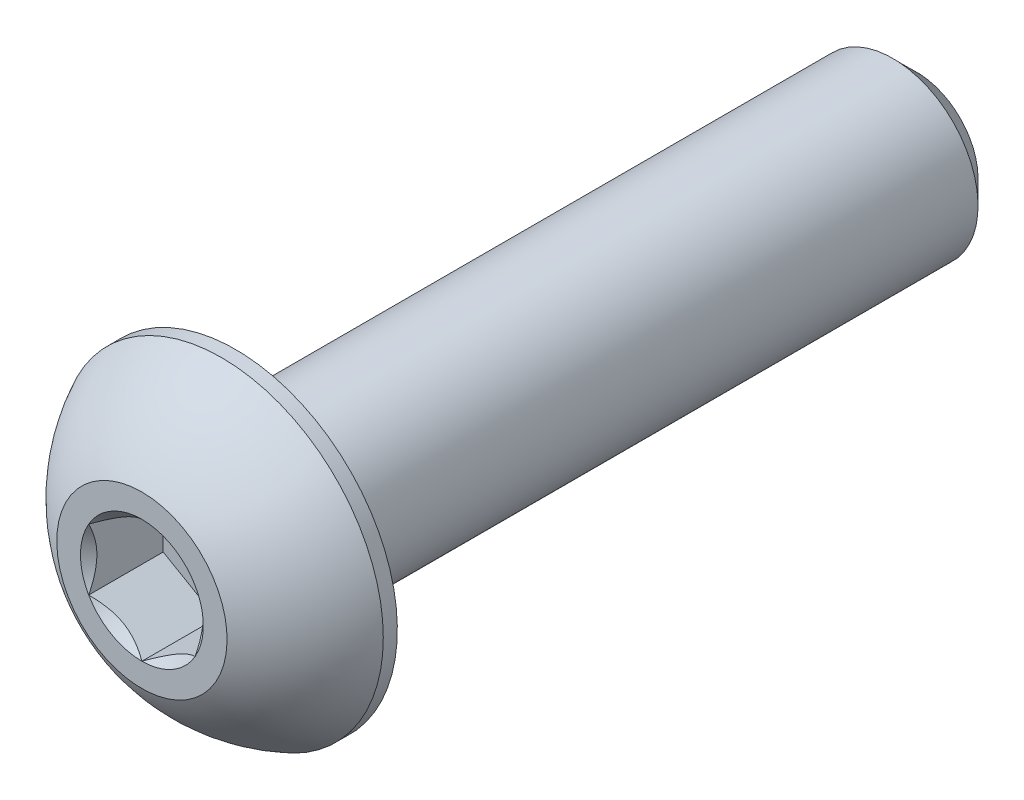
ISO-10303-21;
HEADER;
FILE_DESCRIPTION(('STEP AP214'),'2;1');
FILE_NAME('part.step','',(''),(''),'','','');
FILE_SCHEMA(('AUTOMOTIVE_DESIGN { 1 0 10303 214 1 1 1 1 }'));
ENDSEC;
DATA;
#1=APPLICATION_CONTEXT('core data for automotive mechanical design processes');
#2=APPLICATION_PROTOCOL_DEFINITION('international standard','automotive_design',2000,#1);
#3=PRODUCT_CONTEXT('',#1,'mechanical');
#4=PRODUCT('Part','Part','',(#3));
#5=PRODUCT_RELATED_PRODUCT_CATEGORY('part','',(#4));
#6=PRODUCT_DEFINITION_FORMATION('','',#4);
#7=PRODUCT_DEFINITION_CONTEXT('part definition',#1,'design');
#8=PRODUCT_DEFINITION('design','',#6,#7);
#9=PRODUCT_DEFINITION_SHAPE('','',#8);
#10=(LENGTH_UNIT() NAMED_UNIT(*) SI_UNIT(.MILLI.,.METRE.));
#11=(NAMED_UNIT(*) PLANE_ANGLE_UNIT() SI_UNIT($,.RADIAN.));
#12=(NAMED_UNIT(*) SI_UNIT($,.STERADIAN.) SOLID_ANGLE_UNIT());
#13=UNCERTAINTY_MEASURE_WITH_UNIT(LENGTH_MEASURE(1.E-05),#10,'distance_accuracy_value','');
#14=(GEOMETRIC_REPRESENTATION_CONTEXT(3) GLOBAL_UNCERTAINTY_ASSIGNED_CONTEXT((#13)) GLOBAL_UNIT_ASSIGNED_CONTEXT((#10,
#11,#12)) REPRESENTATION_CONTEXT('',''));
#15=CARTESIAN_POINT('',(0.,0.,0.));
#16=DIRECTION('',(0.,0.,1.));
#17=DIRECTION('',(1.,0.,0.));
#18=AXIS2_PLACEMENT_3D('',#15,#16,#17);
#19=CARTESIAN_POINT('',(0.,0.,9.1));
#20=DIRECTION('',(0.,0.,-1.));
#21=DIRECTION('',(0.,1.,0.));
#22=AXIS2_PLACEMENT_3D('',#19,#20,#21);
#23=PLANE('',#22);
#24=CARTESIAN_POINT('',(0.,0.,9.1));
#25=DIRECTION('',(0.,0.,1.));
#26=DIRECTION('',(1.,0.,0.));
#27=AXIS2_PLACEMENT_3D('',#24,#25,#26);
#28=CIRCLE('',#27,1.44337567297406);
#29=CARTESIAN_POINT('',(0.,1.44337567297406,9.1));
#30=VERTEX_POINT('',#29);
#31=CARTESIAN_POINT('',(-1.25,0.721687836487033,9.1));
#32=VERTEX_POINT('',#31);
#33=EDGE_CURVE('E216',#30,#32,#28,.T.);
#34=ORIENTED_EDGE('',*,*,#33,.F.);
#35=CARTESIAN_POINT('',(1.25,0.721687836487032,9.1));
#36=VERTEX_POINT('',#35);
#37=EDGE_CURVE('E218',#36,#30,#28,.T.);
#38=ORIENTED_EDGE('',*,*,#37,.F.);
#39=CARTESIAN_POINT('',(1.25,-0.721687836487032,9.1));
#40=VERTEX_POINT('',#39);
#41=EDGE_CURVE('E56',#40,#36,#28,.T.);
#42=ORIENTED_EDGE('',*,*,#41,.F.);
#43=CARTESIAN_POINT('',(0.,-1.44337567297406,9.1));
#44=VERTEX_POINT('',#43);
#45=EDGE_CURVE('E63',#44,#40,#28,.T.);
#46=ORIENTED_EDGE('',*,*,#45,.F.);
#47=CARTESIAN_POINT('',(-1.25,-0.721687836487033,9.1));
#48=VERTEX_POINT('',#47);
#49=EDGE_CURVE('E223',#48,#44,#28,.T.);
#50=ORIENTED_EDGE('',*,*,#49,.F.);
#51=EDGE_CURVE('E220',#32,#48,#28,.T.);
#52=ORIENTED_EDGE('',*,*,#51,.F.);
#53=EDGE_LOOP('',(#34,#38,#42,#46,#50,#52));
#54=FACE_BOUND('',#53,.T.);
#55=CARTESIAN_POINT('',(0.,0.,9.1));
#56=DIRECTION('',(0.,0.,1.));
#57=DIRECTION('',(0.,-1.,0.));
#58=AXIS2_PLACEMENT_3D('',#55,#56,#57);
#59=CIRCLE('',#58,2.);
#60=CARTESIAN_POINT('',(0.,2.,9.1));
#61=VERTEX_POINT('',#60);
#62=EDGE_CURVE('E50',#61,#61,#59,.T.);
#63=ORIENTED_EDGE('',*,*,#62,.T.);
#64=EDGE_LOOP('',(#63));
#65=FACE_BOUND('',#64,.T.);
#66=ADVANCED_FACE('F37',(#54,#65),#23,.F.);
#67=CARTESIAN_POINT('',(0.,0.,5.37355614973262));
#68=DIRECTION('',(0.,0.,1.));
#69=DIRECTION('',(0.,1.,0.));
#70=AXIS2_PLACEMENT_3D('',#67,#68,#69);
#71=SPHERICAL_SURFACE('',#70,4.22922968981298);
#72=CARTESIAN_POINT('',(0.,0.,7.23));
#73=DIRECTION('',(0.,0.,1.));
#74=DIRECTION('',(0.,-1.,0.));
#75=AXIS2_PLACEMENT_3D('',#72,#73,#74);
#76=CIRCLE('',#75,3.8);
#77=CARTESIAN_POINT('',(0.,3.8,7.23));
#78=VERTEX_POINT('',#77);
#79=EDGE_CURVE('E162',#78,#78,#76,.T.);
#80=CARTESIAN_POINT('',(0.,2.,9.1));
#81=CARTESIAN_POINT('',(0.,2.02421343985613,9.08700457403551));
#82=CARTESIAN_POINT('',(0.,2.04830018323974,9.07377308703487));
#83=CARTESIAN_POINT('',(0.,2.09621120342125,9.04684315849425));
#84=CARTESIAN_POINT('',(0.,2.12003548021916,9.03314471695428));
#85=CARTESIAN_POINT('',(0.,2.16741249358866,9.00528604686797));
#86=CARTESIAN_POINT('',(0.,2.19096523016025,8.99112581832164));
#87=CARTESIAN_POINT('',(0.,2.23779021933682,8.96234896476405));
#88=CARTESIAN_POINT('',(0.,2.2610624719418,8.94773233975278));
#89=CARTESIAN_POINT('',(0.,2.30731764886071,8.91804824448586));
#90=CARTESIAN_POINT('',(0.,2.33030057317464,8.9029807742302));
#91=CARTESIAN_POINT('',(0.,2.37596836104234,8.87240071441713));
#92=CARTESIAN_POINT('',(0.,2.39865322459611,8.85688812485971));
#93=CARTESIAN_POINT('',(0.,2.44371627121513,8.82542372060412));
#94=CARTESIAN_POINT('',(0.,2.46609445428037,8.80947190590595));
#95=CARTESIAN_POINT('',(0.,2.51053563686181,8.77713511266833));
#96=CARTESIAN_POINT('',(0.,2.532598636378,8.76075013412888));
#97=CARTESIAN_POINT('',(0.,2.57640106852491,8.72755323903277));
#98=CARTESIAN_POINT('',(0.,2.59814050115564,8.71074132247611));
#99=CARTESIAN_POINT('',(0.,2.64128753915153,8.67669693941185));
#100=CARTESIAN_POINT('',(0.,2.6626951445167,8.65946447290426));
#101=CARTESIAN_POINT('',(0.,2.70517039368395,8.62458553779704));
#102=CARTESIAN_POINT('',(0.,2.72623803748602,8.60693906919741));
#103=CARTESIAN_POINT('',(0.,2.76802535840618,8.57123883507559));
#104=CARTESIAN_POINT('',(0.,2.78874503552428,8.55318506955341));
#105=CARTESIAN_POINT('',(0.,2.82982855017313,8.51667710151719));
#106=CARTESIAN_POINT('',(0.,2.85019238770388,8.49822289900316));
#107=CARTESIAN_POINT('',(0.,2.89055648548394,8.46092106906898));
#108=CARTESIAN_POINT('',(0.,2.91055674573324,8.44207344164884));
#109=CARTESIAN_POINT('',(0.,2.95018608940552,8.40399192347874));
#110=CARTESIAN_POINT('',(0.,2.96981517282852,8.38475803272878));
#111=CARTESIAN_POINT('',(0.,3.00869470434027,8.34591129624471));
#112=CARTESIAN_POINT('',(0.,3.02794515242903,8.3262984505106));
#113=CARTESIAN_POINT('',(0.,3.06606009863533,8.28670125639628));
#114=CARTESIAN_POINT('',(0.,3.08492459675286,8.26671690801607));
#115=CARTESIAN_POINT('',(0.,3.12226047503002,8.22638430210832));
#116=CARTESIAN_POINT('',(0.,3.14073185518964,8.20603604458079));
#117=CARTESIAN_POINT('',(0.,3.17727447893821,8.16498335215256));
#118=CARTESIAN_POINT('',(0.,3.19534572252715,8.14427891725186));
#119=CARTESIAN_POINT('',(0.,3.23108120656242,8.10252173718902));
#120=CARTESIAN_POINT('',(0.,3.24874544700874,8.08146899202686));
#121=CARTESIAN_POINT('',(0.,3.28366021283673,8.03902319090103));
#122=CARTESIAN_POINT('',(0.,3.30091073821838,8.01763013493736));
#123=CARTESIAN_POINT('',(0.,3.33499151919534,7.97451184097717));
#124=CARTESIAN_POINT('',(0.,3.35182177479063,7.95278660298065));
#125=CARTESIAN_POINT('',(0.,3.38505562116371,7.90901219994321));
#126=CARTESIAN_POINT('',(0.,3.40145921194149,7.88696303490229));
#127=CARTESIAN_POINT('',(0.,3.43383349577046,7.84254915584848));
#128=CARTESIAN_POINT('',(0.,3.44980418882166,7.8201844418356));
#129=CARTESIAN_POINT('',(0.,3.48130660877275,7.77514796280767));
#130=CARTESIAN_POINT('',(0.,3.49683833567264,7.75247619779264));
#131=CARTESIAN_POINT('',(0.,3.52745692170931,7.70683423141033));
#132=CARTESIAN_POINT('',(0.,3.5425437808461,7.68386403004306));
#133=CARTESIAN_POINT('',(0.,3.57226689871518,7.63763391896935));
#134=CARTESIAN_POINT('',(0.,3.58690315744747,7.61437400926291));
#135=CARTESIAN_POINT('',(0.,3.61571951333199,7.56757331973341));
#136=CARTESIAN_POINT('',(0.,3.62989961048422,7.54403253991033));
#137=CARTESIAN_POINT('',(0.,3.65779825442823,7.4966790546141));
#138=CARTESIAN_POINT('',(0.,3.67151680122002,7.47286634914094));
#139=CARTESIAN_POINT('',(0.,3.69848713452321,7.42497806212234));
#140=CARTESIAN_POINT('',(0.,3.71173892103461,7.4009024805769));
#141=CARTESIAN_POINT('',(0.,3.73777068821038,7.35249758420785));
#142=CARTESIAN_POINT('',(0.,3.75055066887474,7.32816826938425));
#143=CARTESIAN_POINT('',(0.,3.77563400658953,7.27926517055481));
#144=CARTESIAN_POINT('',(0.,3.78793736363997,7.25469138654898));
#145=CARTESIAN_POINT('',(0.,3.8,7.23));
#146=B_SPLINE_CURVE_WITH_KNOTS('',3,(#80,#81,#82,#83,#84,#85,#86,#87,#88,#89,#90,#91,#92,#93,
#94,#95,#96,#97,#98,#99,#100,#101,#102,#103,#104,#105,#106,#107,#108,#109,#110,#111,#112,#113,
#114,#115,#116,#117,#118,#119,#120,#121,#122,#123,#124,#125,#126,#127,#128,#129,#130,#131,#132,
#133,#134,#135,#136,#137,#138,#139,#140,#141,#142,#143,#144,#145),.UNSPECIFIED.,.F.,.F.,(4,2,2,
2,2,2,2,2,2,2,2,2,2,2,2,2,2,2,2,2,2,2,2,2,2,2,2,2,2,2,2,2,4),(0.,0.0824398589102645,
0.164879717820529,0.247319576730793,0.329759435641057,0.412199294551322,0.494639153461586,
0.577079012371851,0.659518871282115,0.74195873019238,0.824398589102644,0.906838448012908,
0.989278306923173,1.07171816583344,1.1541580247437,1.23659788365397,1.31903774256423,
1.40147760147449,1.48391746038476,1.56635731929502,1.64879717820529,1.73123703711555,
1.81367689602582,1.89611675493608,1.97855661384634,2.06099647275661,2.14343633166687,
2.22587619057714,2.3083160494874,2.39075590839767,2.47319576730793,2.5556356262182,
2.63807548512846),.UNSPECIFIED.);
#147=EDGE_CURVE('BSEAM168',#61,#78,#146,.T.);
#148=ORIENTED_EDGE('',*,*,#62,.F.);
#149=ORIENTED_EDGE('',*,*,#79,.T.);
#150=ORIENTED_EDGE('',*,*,#147,.T.);
#151=ORIENTED_EDGE('',*,*,#147,.F.);
#152=EDGE_LOOP('',(#148,#150,#149,#151));
#153=FACE_BOUND('',#152,.T.);
#154=ADVANCED_FACE('F168',(#153),#71,.T.);
#155=CARTESIAN_POINT('',(0.,0.,9.1));
#156=DIRECTION('',(0.,0.,1.));
#157=DIRECTION('',(0.,-1.,0.));
#158=AXIS2_PLACEMENT_3D('',#155,#156,#157);
#159=CYLINDRICAL_SURFACE('',#158,3.8);
#160=ORIENTED_EDGE('',*,*,#79,.F.);
#161=EDGE_LOOP('',(#160));
#162=FACE_BOUND('',#161,.T.);
#163=CARTESIAN_POINT('',(0.,0.,6.9));
#164=DIRECTION('',(0.,0.,1.));
#165=DIRECTION('',(0.,-1.,0.));
#166=AXIS2_PLACEMENT_3D('',#163,#164,#165);
#167=CIRCLE('',#166,3.8);
#168=CARTESIAN_POINT('',(0.,-3.8,6.9));
#169=VERTEX_POINT('',#168);
#170=EDGE_CURVE('E159',#169,#169,#167,.T.);
#171=ORIENTED_EDGE('',*,*,#170,.T.);
#172=EDGE_LOOP('',(#171));
#173=FACE_BOUND('',#172,.T.);
#174=ADVANCED_FACE('F171',(#162,#173),#159,.T.);
#175=CARTESIAN_POINT('',(0.,2.,6.9));
#176=DIRECTION('',(0.,0.,1.));
#177=DIRECTION('',(0.,-1.,0.));
#178=AXIS2_PLACEMENT_3D('',#175,#176,#177);
#179=PLANE('',#178);
#180=ORIENTED_EDGE('',*,*,#170,.F.);
#181=EDGE_LOOP('',(#180));
#182=FACE_BOUND('',#181,.T.);
#183=CARTESIAN_POINT('',(0.,0.,6.9));
#184=DIRECTION('',(0.,0.,1.));
#185=DIRECTION('',(0.,-1.,0.));
#186=AXIS2_PLACEMENT_3D('',#183,#184,#185);
#187=CIRCLE('',#186,1.99999999999999);
#188=CARTESIAN_POINT('',(0.,-1.99999999999999,6.9));
#189=VERTEX_POINT('',#188);
#190=EDGE_CURVE('E156',#189,#189,#187,.T.);
#191=ORIENTED_EDGE('',*,*,#190,.T.);
#192=EDGE_LOOP('',(#191));
#193=FACE_BOUND('',#192,.T.);
#194=ADVANCED_FACE('F176',(#182,#193),#179,.F.);
#195=CARTESIAN_POINT('',(0.,0.,9.1));
#196=DIRECTION('',(0.,0.,1.));
#197=DIRECTION('',(0.,-1.,0.));
#198=AXIS2_PLACEMENT_3D('',#195,#196,#197);
#199=CYLINDRICAL_SURFACE('',#198,2.);
#200=ORIENTED_EDGE('',*,*,#190,.F.);
#201=EDGE_LOOP('',(#200));
#202=FACE_BOUND('',#201,.T.);
#203=CARTESIAN_POINT('',(0.,0.,-8.54));
#204=DIRECTION('',(0.,0.,1.));
#205=DIRECTION('',(0.,-1.,0.));
#206=AXIS2_PLACEMENT_3D('',#203,#204,#205);
#207=CIRCLE('',#206,2.);
#208=CARTESIAN_POINT('',(0.,-1.99999999999999,-8.54));
#209=VERTEX_POINT('',#208);
#210=EDGE_CURVE('E153',#209,#209,#207,.T.);
#211=ORIENTED_EDGE('',*,*,#210,.T.);
#212=EDGE_LOOP('',(#211));
#213=FACE_BOUND('',#212,.T.);
#214=ADVANCED_FACE('F182',(#202,#213),#199,.T.);
#215=CARTESIAN_POINT('',(0.,0.,-9.1));
#216=DIRECTION('',(0.,0.,1.));
#217=DIRECTION('',(0.,-1.,0.));
#218=AXIS2_PLACEMENT_3D('',#215,#216,#217);
#219=CONICAL_SURFACE('',#218,1.44,0.785398163397447);
#220=ORIENTED_EDGE('',*,*,#210,.F.);
#221=EDGE_LOOP('',(#220));
#222=FACE_BOUND('',#221,.T.);
#223=CARTESIAN_POINT('',(0.,0.,-9.1));
#224=DIRECTION('',(0.,0.,1.));
#225=DIRECTION('',(0.,-1.,0.));
#226=AXIS2_PLACEMENT_3D('',#223,#224,#225);
#227=CIRCLE('',#226,1.44);
#228=CARTESIAN_POINT('',(0.,-1.44,-9.1));
#229=VERTEX_POINT('',#228);
#230=EDGE_CURVE('E140',#229,#229,#227,.T.);
#231=ORIENTED_EDGE('',*,*,#230,.T.);
#232=EDGE_LOOP('',(#231));
#233=FACE_BOUND('',#232,.T.);
#234=ADVANCED_FACE('F188',(#222,#233),#219,.T.);
#235=CARTESIAN_POINT('',(0.,0.,-9.1));
#236=DIRECTION('',(0.,0.,1.));
#237=DIRECTION('',(0.,-1.,0.));
#238=AXIS2_PLACEMENT_3D('',#235,#236,#237);
#239=PLANE('',#238);
#240=ORIENTED_EDGE('',*,*,#230,.F.);
#241=EDGE_LOOP('',(#240));
#242=FACE_BOUND('',#241,.T.);
#243=ADVANCED_FACE('F194',(#242),#239,.F.);
#244=CARTESIAN_POINT('',(0.,0.,9.1));
#245=DIRECTION('',(0.,0.,1.));
#246=DIRECTION('',(1.,0.,0.));
#247=AXIS2_PLACEMENT_3D('',#244,#245,#246);
#248=CONICAL_SURFACE('',#247,1.44337567297406,0.78539816339745);
#249=ORIENTED_EDGE('',*,*,#33,.T.);
#250=CARTESIAN_POINT('',(0.000199999999999687,1.4434911430279,9.10011548390914));
#251=CARTESIAN_POINT('',(-0.0427751670715871,1.41867941875065,9.0753216680551));
#252=CARTESIAN_POINT('',(-0.0864690047459485,1.39345276980743,9.05198373441868));
#253=CARTESIAN_POINT('',(-0.175565930841942,1.34201263554194,9.00925200408454));
#254=CARTESIAN_POINT('',(-0.220977498357064,1.31579425481276,8.98988199236041));
#255=CARTESIAN_POINT('',(-0.31254782093526,1.26292610442246,8.95670048341348));
#256=CARTESIAN_POINT('',(-0.358683240175886,1.23628980770471,8.94280555905266));
#257=CARTESIAN_POINT('',(-0.451970080407593,1.18243062538508,8.92139728216064));
#258=CARTESIAN_POINT('',(-0.49911864913638,1.15520938653761,8.91386794156679));
#259=CARTESIAN_POINT('',(-0.580373556887252,1.10829684367467,8.9070744980507));
#260=CARTESIAN_POINT('',(-0.614374876627941,1.08866617256958,8.90606855910435));
#261=CARTESIAN_POINT('',(-0.682317764432477,1.04943932800611,8.90776141491132));
#262=CARTESIAN_POINT('',(-0.716259317655657,1.02984316311599,8.91046102721554));
#263=CARTESIAN_POINT('',(-0.783814856457499,0.9908399546035,8.91940893031638));
#264=CARTESIAN_POINT('',(-0.817428507286775,0.971433104248771,8.92566052589971));
#265=CARTESIAN_POINT('',(-0.884094638217813,0.932943395609906,8.9413756814139));
#266=CARTESIAN_POINT('',(-0.917146871030295,0.913860680098301,8.95084062008746));
#267=CARTESIAN_POINT('',(-1.00179969160026,0.864986351354568,8.97893139068758));
#268=CARTESIAN_POINT('',(-1.05286649242964,0.835502920149076,8.9996701574522));
#269=CARTESIAN_POINT('',(-1.15300085411325,0.777690319475909,9.04638713467148));
#270=CARTESIAN_POINT('',(-1.20207431157827,0.749357745598417,9.07234829594677));
#271=CARTESIAN_POINT('',(-1.2502,0.721572366433195,9.10011548390914));
#272=B_SPLINE_CURVE_WITH_KNOTS('',3,(#250,#251,#252,#253,#254,#255,#256,#257,#258,#259,#260,
#261,#262,#263,#264,#265,#266,#267,#268,#269,#270,#271),.UNSPECIFIED.,.F.,.F.,(4,2,2,2,2,2,2,2,
2,2,4),(0.,0.166533409618304,0.334037607289761,0.498880396489697,0.663307919240274,
0.780963963458826,0.898645970148452,1.01643764860773,1.13427993171549,1.32148652032141,
1.50809158792573),.UNSPECIFIED.);
#273=EDGE_CURVE('E11',#30,#32,#272,.T.);
#274=ORIENTED_EDGE('',*,*,#273,.F.);
#275=EDGE_LOOP('',(#249,#274));
#276=FACE_BOUND('',#275,.T.);
#277=ADVANCED_FACE('F199',(#276),#248,.F.);
#278=ORIENTED_EDGE('',*,*,#51,.T.);
#279=CARTESIAN_POINT('',(-1.25,-1.43934010808077,9.56298209689233));
#280=CARTESIAN_POINT('',(-1.25,-1.40429313005659,9.53652492263289));
#281=CARTESIAN_POINT('',(-1.25,-1.36905087135599,9.51032716035428));
#282=CARTESIAN_POINT('',(-1.25,-1.29809650706311,9.45855757183958));
#283=CARTESIAN_POINT('',(-1.25,-1.26238428576495,9.4329859043563));
#284=CARTESIAN_POINT('',(-1.25,-1.15390111792708,9.35700599368946));
#285=CARTESIAN_POINT('',(-1.25,-1.08031646726264,9.30774028618957));
#286=CARTESIAN_POINT('',(-1.25,-0.926012322755095,9.21102583026313));
#287=CARTESIAN_POINT('',(-1.25,-0.845125318656146,9.1638412989418));
#288=CARTESIAN_POINT('',(-1.25,-0.679311174076602,9.07753073439041));
#289=CARTESIAN_POINT('',(-1.25,-0.594398891026688,9.0383775346269));
#290=CARTESIAN_POINT('',(-1.25,-0.46694481246074,8.99047722368829));
#291=CARTESIAN_POINT('',(-1.25,-0.426289985812821,8.97672948978634));
#292=CARTESIAN_POINT('',(-1.25,-0.343998850091267,8.95249792745054));
#293=CARTESIAN_POINT('',(-1.25,-0.302362473614962,8.94201432386977));
#294=CARTESIAN_POINT('',(-1.25,-0.219052696285666,8.9250301617483));
#295=CARTESIAN_POINT('',(-1.25,-0.1773934284745,8.91846136047137));
#296=CARTESIAN_POINT('',(-1.25,-0.0936293693401927,8.90943505345776));
#297=CARTESIAN_POINT('',(-1.25,-0.0515246558543966,8.90697684099727));
#298=CARTESIAN_POINT('',(-1.25,0.0311890576306309,8.90635406201329));
#299=CARTESIAN_POINT('',(-1.25,0.0717969625499297,8.90803711684625));
#300=CARTESIAN_POINT('',(-1.25,0.152668636885196,8.91526827059791));
#301=CARTESIAN_POINT('',(-1.25,0.192932338835357,8.92081711041311));
#302=CARTESIAN_POINT('',(-1.25,0.273499879165294,8.93557103646495));
#303=CARTESIAN_POINT('',(-1.25,0.31379218061851,8.9448381759641));
#304=CARTESIAN_POINT('',(-1.25,0.393496413911456,8.96653617845735));
#305=CARTESIAN_POINT('',(-1.25,0.432908419115058,8.97896677673064));
#306=CARTESIAN_POINT('',(-1.25,0.556992735862297,9.02277935293144));
#307=CARTESIAN_POINT('',(-1.25,0.639898924666084,9.05915107287595));
#308=CARTESIAN_POINT('',(-1.25,0.8018165554997,9.14001916217833));
#309=CARTESIAN_POINT('',(-1.25,0.880812666325043,9.18454472091199));
#310=CARTESIAN_POINT('',(-1.25,1.0317856127975,9.27640487666662));
#311=CARTESIAN_POINT('',(-1.25,1.10391618485086,9.32348993391625));
#312=CARTESIAN_POINT('',(-1.25,1.2101860604331,9.39627856159854));
#313=CARTESIAN_POINT('',(-1.25,1.24515069969379,9.42079808539336));
#314=CARTESIAN_POINT('',(-1.25,1.31460220852736,9.47048563676568));
#315=CARTESIAN_POINT('',(-1.25,1.34908920596618,9.49565348541552));
#316=CARTESIAN_POINT('',(-1.25,1.38337731682911,9.52109014884121));
#317=B_SPLINE_CURVE_WITH_KNOTS('',3,(#279,#280,#281,#282,#283,#284,#285,#286,#287,#288,#289,
#290,#291,#292,#293,#294,#295,#296,#297,#298,#299,#300,#301,#302,#303,#304,#305,#306,#307,#308,
#309,#310,#311,#312,#313,#314,#315,#316),.UNSPECIFIED.,.F.,.F.,(4,2,2,2,2,2,2,2,2,2,2,2,2,2,2,2,
2,2,4),(0.,0.131732960381448,0.263498984161645,0.529042014455826,0.80974192613462,
1.08947609717225,1.21811634272577,1.346765447839,1.47310084517844,1.59941451973784,
1.72115042167849,1.84290966131735,1.96679153905342,2.09066305366039,2.36146692896009,
2.63325989198491,2.89154668212279,3.01965734507713,3.14773302245628),.UNSPECIFIED.);
#318=EDGE_CURVE('E222',#32,#48,#317,.F.);
#319=ORIENTED_EDGE('',*,*,#318,.F.);
#320=EDGE_LOOP('',(#278,#319));
#321=FACE_BOUND('',#320,.T.);
#322=ADVANCED_FACE('F205',(#321),#248,.F.);
#323=ORIENTED_EDGE('',*,*,#49,.T.);
#324=CARTESIAN_POINT('',(-1.2502,-0.721572366433194,9.10011548390914));
#325=CARTESIAN_POINT('',(-1.20722483292841,-0.746384090710444,9.0753216680551));
#326=CARTESIAN_POINT('',(-1.16353099525405,-0.771610739653665,9.05198373441868));
#327=CARTESIAN_POINT('',(-1.07443406915806,-0.823050873919155,9.00925200408454));
#328=CARTESIAN_POINT('',(-1.02902250164294,-0.849269254648334,8.98988199236041));
#329=CARTESIAN_POINT('',(-0.937452179064739,-0.902137405038636,8.95670048341348));
#330=CARTESIAN_POINT('',(-0.891316759824113,-0.928773701756388,8.94280555905265));
#331=CARTESIAN_POINT('',(-0.798029919592406,-0.982632884076013,8.92139728216064));
#332=CARTESIAN_POINT('',(-0.750881350863619,-1.00985412292348,8.91386794156679));
#333=CARTESIAN_POINT('',(-0.669626443112747,-1.05676666578643,8.9070744980507));
#334=CARTESIAN_POINT('',(-0.635625123372058,-1.07639733689152,8.90606855910435));
#335=CARTESIAN_POINT('',(-0.567682235567522,-1.11562418145499,8.90776141491132));
#336=CARTESIAN_POINT('',(-0.533740682344342,-1.1352203463451,8.91046102721554));
#337=CARTESIAN_POINT('',(-0.4661851435425,-1.1742235548576,8.91940893031638));
#338=CARTESIAN_POINT('',(-0.432571492713224,-1.19363040521233,8.92566052589971));
#339=CARTESIAN_POINT('',(-0.365905361782186,-1.23212011385119,8.9413756814139));
#340=CARTESIAN_POINT('',(-0.332853128969704,-1.2512028293628,8.95084062008746));
#341=CARTESIAN_POINT('',(-0.248200308399735,-1.30007715810653,8.97893139068758));
#342=CARTESIAN_POINT('',(-0.197133507570362,-1.32956058931202,8.9996701574522));
#343=CARTESIAN_POINT('',(-0.0969991458867455,-1.38737318998519,9.04638713467148));
#344=CARTESIAN_POINT('',(-0.0479256884217311,-1.41570576386268,9.07234829594677));
#345=CARTESIAN_POINT('',(0.000199999999999445,-1.4434911430279,9.10011548390914));
#346=B_SPLINE_CURVE_WITH_KNOTS('',3,(#324,#325,#326,#327,#328,#329,#330,#331,#332,#333,#334,
#335,#336,#337,#338,#339,#340,#341,#342,#343,#344,#345),.UNSPECIFIED.,.F.,.F.,(4,2,2,2,2,2,2,2,
2,2,4),(0.,0.166533409618305,0.334037607289762,0.498880396489699,0.663307919240275,
0.780963963458827,0.898645970148453,1.01643764860773,1.1342799317155,1.32148652032141,
1.50809158792573),.UNSPECIFIED.);
#347=EDGE_CURVE('E232',#48,#44,#346,.T.);
#348=ORIENTED_EDGE('',*,*,#347,.F.);
#349=EDGE_LOOP('',(#323,#348));
#350=FACE_BOUND('',#349,.T.);
#351=ADVANCED_FACE('F282',(#350),#248,.F.);
#352=ORIENTED_EDGE('',*,*,#45,.T.);
#353=CARTESIAN_POINT('',(-0.000200000000000272,-1.4434911430279,9.10011548390914));
#354=CARTESIAN_POINT('',(0.0427751670715867,-1.41867941875065,9.0753216680551));
#355=CARTESIAN_POINT('',(0.0864690047459484,-1.39345276980743,9.05198373441868));
#356=CARTESIAN_POINT('',(0.175565930841943,-1.34201263554194,9.00925200408454));
#357=CARTESIAN_POINT('',(0.220977498357065,-1.31579425481276,8.98988199236041));
#358=CARTESIAN_POINT('',(0.31254782093526,-1.26292610442246,8.95670048341348));
#359=CARTESIAN_POINT('',(0.358683240175886,-1.23628980770471,8.94280555905265));
#360=CARTESIAN_POINT('',(0.451970080407593,-1.18243062538508,8.92139728216064));
#361=CARTESIAN_POINT('',(0.499118649136381,-1.15520938653761,8.91386794156679));
#362=CARTESIAN_POINT('',(0.580373556887253,-1.10829684367467,8.9070744980507));
#363=CARTESIAN_POINT('',(0.614374876627942,-1.08866617256958,8.90606855910435));
#364=CARTESIAN_POINT('',(0.682317764432478,-1.04943932800611,8.90776141491132));
#365=CARTESIAN_POINT('',(0.716259317655658,-1.02984316311599,8.91046102721554));
#366=CARTESIAN_POINT('',(0.7838148564575,-0.990839954603498,8.91940893031638));
#367=CARTESIAN_POINT('',(0.817428507286776,-0.97143310424877,8.92566052589971));
#368=CARTESIAN_POINT('',(0.884094638217814,-0.932943395609904,8.9413756814139));
#369=CARTESIAN_POINT('',(0.917146871030297,-0.9138606800983,8.95084062008746));
#370=CARTESIAN_POINT('',(1.00179969160026,-0.864986351354567,8.97893139068758));
#371=CARTESIAN_POINT('',(1.05286649242964,-0.835502920149076,8.9996701574522));
#372=CARTESIAN_POINT('',(1.15300085411325,-0.777690319475909,9.04638713467148));
#373=CARTESIAN_POINT('',(1.20207431157827,-0.749357745598417,9.07234829594677));
#374=CARTESIAN_POINT('',(1.2502,-0.721572366433194,9.10011548390914));
#375=B_SPLINE_CURVE_WITH_KNOTS('',3,(#353,#354,#355,#356,#357,#358,#359,#360,#361,#362,#363,
#364,#365,#366,#367,#368,#369,#370,#371,#372,#373,#374),.UNSPECIFIED.,.F.,.F.,(4,2,2,2,2,2,2,2,
2,2,4),(0.,0.166533409618305,0.334037607289762,0.498880396489699,0.663307919240275,
0.780963963458828,0.898645970148454,1.01643764860773,1.1342799317155,1.32148652032141,
1.50809158792573),.UNSPECIFIED.);
#376=EDGE_CURVE('E270',#44,#40,#375,.T.);
#377=ORIENTED_EDGE('',*,*,#376,.F.);
#378=EDGE_LOOP('',(#352,#377));
#379=FACE_BOUND('',#378,.T.);
#380=ADVANCED_FACE('F283',(#379),#248,.F.);
#381=ORIENTED_EDGE('',*,*,#41,.T.);
#382=CARTESIAN_POINT('',(1.25,-1.43934010808077,9.56298209689233));
#383=CARTESIAN_POINT('',(1.25,-1.40429313005659,9.53652492263289));
#384=CARTESIAN_POINT('',(1.25,-1.36905087135599,9.51032716035428));
#385=CARTESIAN_POINT('',(1.25,-1.29809650706311,9.45855757183958));
#386=CARTESIAN_POINT('',(1.25,-1.26238428576495,9.4329859043563));
#387=CARTESIAN_POINT('',(1.25,-1.15390111792708,9.35700599368946));
#388=CARTESIAN_POINT('',(1.25,-1.08031646726264,9.30774028618957));
#389=CARTESIAN_POINT('',(1.25,-0.926012322755094,9.21102583026313));
#390=CARTESIAN_POINT('',(1.25,-0.845125318656145,9.1638412989418));
#391=CARTESIAN_POINT('',(1.25,-0.679311174076601,9.07753073439041));
#392=CARTESIAN_POINT('',(1.25,-0.594398891026687,9.0383775346269));
#393=CARTESIAN_POINT('',(1.25,-0.466944812460739,8.99047722368829));
#394=CARTESIAN_POINT('',(1.25,-0.426289985812821,8.97672948978634));
#395=CARTESIAN_POINT('',(1.25,-0.343998850091267,8.95249792745054));
#396=CARTESIAN_POINT('',(1.25,-0.302362473614961,8.94201432386977));
#397=CARTESIAN_POINT('',(1.25,-0.219052696285665,8.9250301617483));
#398=CARTESIAN_POINT('',(1.25,-0.1773934284745,8.91846136047137));
#399=CARTESIAN_POINT('',(1.25,-0.0936293693401918,8.90943505345776));
#400=CARTESIAN_POINT('',(1.25,-0.0515246558543957,8.90697684099727));
#401=CARTESIAN_POINT('',(1.25,0.0311890576306319,8.90635406201329));
#402=CARTESIAN_POINT('',(1.25,0.0717969625499308,8.90803711684625));
#403=CARTESIAN_POINT('',(1.25,0.152668636885198,8.91526827059791));
#404=CARTESIAN_POINT('',(1.25,0.192932338835358,8.92081711041311));
#405=CARTESIAN_POINT('',(1.25,0.273499879165296,8.93557103646495));
#406=CARTESIAN_POINT('',(1.25,0.313792180618512,8.9448381759641));
#407=CARTESIAN_POINT('',(1.25,0.393496413911458,8.96653617845735));
#408=CARTESIAN_POINT('',(1.25,0.432908419115059,8.97896677673064));
#409=CARTESIAN_POINT('',(1.25,0.556992735862298,9.02277935293144));
#410=CARTESIAN_POINT('',(1.25,0.639898924666086,9.05915107287596));
#411=CARTESIAN_POINT('',(1.25,0.801816555499702,9.14001916217834));
#412=CARTESIAN_POINT('',(1.25,0.880812666325045,9.18454472091199));
#413=CARTESIAN_POINT('',(1.25,1.0317856127975,9.27640487666662));
#414=CARTESIAN_POINT('',(1.25,1.10391618485086,9.32348993391625));
#415=CARTESIAN_POINT('',(1.25,1.2101860604331,9.39627856159854));
#416=CARTESIAN_POINT('',(1.25,1.24515069969379,9.42079808539336));
#417=CARTESIAN_POINT('',(1.25,1.31460220852736,9.47048563676568));
#418=CARTESIAN_POINT('',(1.25,1.34908920596618,9.49565348541552));
#419=CARTESIAN_POINT('',(1.25,1.38337731682912,9.52109014884121));
#420=B_SPLINE_CURVE_WITH_KNOTS('',3,(#382,#383,#384,#385,#386,#387,#388,#389,#390,#391,#392,
#393,#394,#395,#396,#397,#398,#399,#400,#401,#402,#403,#404,#405,#406,#407,#408,#409,#410,#411,
#412,#413,#414,#415,#416,#417,#418,#419),.UNSPECIFIED.,.F.,.F.,(4,2,2,2,2,2,2,2,2,2,2,2,2,2,2,2,
2,2,4),(0.,0.131732960381448,0.263498984161644,0.529042014455826,0.80974192613462,
1.08947609717225,1.21811634272577,1.346765447839,1.47310084517844,1.59941451973784,
1.72115042167849,1.84290966131735,1.96679153905342,2.09066305366039,2.36146692896009,
2.63325989198491,2.89154668212279,3.01965734507713,3.14773302245628),.UNSPECIFIED.);
#421=EDGE_CURVE('E122',#40,#36,#420,.T.);
#422=ORIENTED_EDGE('',*,*,#421,.F.);
#423=EDGE_LOOP('',(#381,#422));
#424=FACE_BOUND('',#423,.T.);
#425=ADVANCED_FACE('F285',(#424),#248,.F.);
#426=ORIENTED_EDGE('',*,*,#37,.T.);
#427=CARTESIAN_POINT('',(1.2502,0.721572366433194,9.10011548390914));
#428=CARTESIAN_POINT('',(1.20722483292841,0.746384090710444,9.0753216680551));
#429=CARTESIAN_POINT('',(1.16353099525405,0.771610739653665,9.05198373441868));
#430=CARTESIAN_POINT('',(1.07443406915806,0.823050873919155,9.00925200408454));
#431=CARTESIAN_POINT('',(1.02902250164294,0.849269254648334,8.98988199236041));
#432=CARTESIAN_POINT('',(0.937452179064739,0.902137405038636,8.95670048341348));
#433=CARTESIAN_POINT('',(0.891316759824113,0.928773701756388,8.94280555905265));
#434=CARTESIAN_POINT('',(0.798029919592406,0.982632884076013,8.92139728216064));
#435=CARTESIAN_POINT('',(0.750881350863619,1.00985412292348,8.91386794156679));
#436=CARTESIAN_POINT('',(0.669626443112746,1.05676666578643,8.9070744980507));
#437=CARTESIAN_POINT('',(0.635625123372058,1.07639733689152,8.90606855910435));
#438=CARTESIAN_POINT('',(0.567682235567521,1.11562418145499,8.90776141491132));
#439=CARTESIAN_POINT('',(0.533740682344341,1.1352203463451,8.91046102721554));
#440=CARTESIAN_POINT('',(0.466185143542499,1.1742235548576,8.91940893031638));
#441=CARTESIAN_POINT('',(0.432571492713224,1.19363040521233,8.92566052589971));
#442=CARTESIAN_POINT('',(0.365905361782186,1.23212011385119,8.9413756814139));
#443=CARTESIAN_POINT('',(0.332853128969703,1.2512028293628,8.95084062008746));
#444=CARTESIAN_POINT('',(0.248200308399734,1.30007715810653,8.97893139068758));
#445=CARTESIAN_POINT('',(0.197133507570361,1.32956058931202,8.9996701574522));
#446=CARTESIAN_POINT('',(0.0969991458867447,1.38737318998519,9.04638713467148));
#447=CARTESIAN_POINT('',(0.0479256884217304,1.41570576386268,9.07234829594677));
#448=CARTESIAN_POINT('',(-0.00019999999999985,1.4434911430279,9.10011548390914));
#449=B_SPLINE_CURVE_WITH_KNOTS('',3,(#427,#428,#429,#430,#431,#432,#433,#434,#435,#436,#437,
#438,#439,#440,#441,#442,#443,#444,#445,#446,#447,#448),.UNSPECIFIED.,.F.,.F.,(4,2,2,2,2,2,2,2,
2,2,4),(0.,0.166533409618304,0.334037607289763,0.4988803964897,0.663307919240276,
0.780963963458828,0.898645970148454,1.01643764860773,1.1342799317155,1.32148652032141,
1.50809158792573),.UNSPECIFIED.);
#450=EDGE_CURVE('E103',#36,#30,#449,.T.);
#451=ORIENTED_EDGE('',*,*,#450,.F.);
#452=EDGE_LOOP('',(#426,#451));
#453=FACE_BOUND('',#452,.T.);
#454=ADVANCED_FACE('F207',(#453),#248,.F.);
#455=CARTESIAN_POINT('',(0.,0.,7.35));
#456=DIRECTION('',(0.,0.,1.));
#457=DIRECTION('',(1.,0.,0.));
#458=AXIS2_PLACEMENT_3D('',#455,#456,#457);
#459=PLANE('',#458);
#460=DIRECTION('',(-0.866025403784439,0.5,0.));
#461=VECTOR('',#460,1.);
#462=CARTESIAN_POINT('',(1.25,0.721687836487032,7.35));
#463=LINE('',#462,#461);
#464=CARTESIAN_POINT('',(1.25,0.721687836487032,7.35));
#465=VERTEX_POINT('',#464);
#466=CARTESIAN_POINT('',(0.,1.44337567297406,7.35));
#467=VERTEX_POINT('',#466);
#468=EDGE_CURVE('E101',#465,#467,#463,.T.);
#469=ORIENTED_EDGE('',*,*,#468,.T.);
#470=DIRECTION('',(-0.866025403784439,-0.5,0.));
#471=VECTOR('',#470,1.);
#472=CARTESIAN_POINT('',(0.,1.44337567297406,7.35));
#473=LINE('',#472,#471);
#474=CARTESIAN_POINT('',(-1.25,0.721687836487033,7.35));
#475=VERTEX_POINT('',#474);
#476=EDGE_CURVE('E110',#467,#475,#473,.T.);
#477=ORIENTED_EDGE('',*,*,#476,.T.);
#478=DIRECTION('',(0.,-1.,0.));
#479=VECTOR('',#478,1.);
#480=CARTESIAN_POINT('',(-1.25,0.721687836487033,7.35));
#481=LINE('',#480,#479);
#482=CARTESIAN_POINT('',(-1.25,-0.721687836487032,7.35));
#483=VERTEX_POINT('',#482);
#484=EDGE_CURVE('E116',#475,#483,#481,.T.);
#485=ORIENTED_EDGE('',*,*,#484,.T.);
#486=DIRECTION('',(0.866025403784439,-0.5,0.));
#487=VECTOR('',#486,1.);
#488=CARTESIAN_POINT('',(-1.25,-0.721687836487032,7.35));
#489=LINE('',#488,#487);
#490=CARTESIAN_POINT('',(0.,-1.44337567297406,7.35));
#491=VERTEX_POINT('',#490);
#492=EDGE_CURVE('E132',#483,#491,#489,.T.);
#493=ORIENTED_EDGE('',*,*,#492,.T.);
#494=DIRECTION('',(0.866025403784439,0.5,0.));
#495=VECTOR('',#494,1.);
#496=CARTESIAN_POINT('',(0.,-1.44337567297406,7.35));
#497=LINE('',#496,#495);
#498=CARTESIAN_POINT('',(1.25,-0.721687836487032,7.35));
#499=VERTEX_POINT('',#498);
#500=EDGE_CURVE('E135',#491,#499,#497,.T.);
#501=ORIENTED_EDGE('',*,*,#500,.T.);
#502=DIRECTION('',(0.,1.,0.));
#503=VECTOR('',#502,1.);
#504=CARTESIAN_POINT('',(1.25,-0.721687836487032,7.35));
#505=LINE('',#504,#503);
#506=EDGE_CURVE('E107',#499,#465,#505,.T.);
#507=ORIENTED_EDGE('',*,*,#506,.T.);
#508=EDGE_LOOP('',(#469,#477,#485,#493,#501,#507));
#509=FACE_BOUND('',#508,.T.);
#510=ADVANCED_FACE('F118',(#509),#459,.T.);
#511=CARTESIAN_POINT('',(0.,1.44337567297406,7.35));
#512=DIRECTION('',(-0.5,0.866025403784439,0.));
#513=DIRECTION('',(-0.866025403784439,-0.5,0.));
#514=AXIS2_PLACEMENT_3D('',#511,#512,#513);
#515=PLANE('',#514);
#516=DIRECTION('',(0.,0.,1.));
#517=VECTOR('',#516,1.);
#518=CARTESIAN_POINT('',(0.,1.44337567297406,7.35));
#519=LINE('',#518,#517);
#520=EDGE_CURVE('E96',#467,#30,#519,.T.);
#521=ORIENTED_EDGE('',*,*,#520,.T.);
#522=ORIENTED_EDGE('',*,*,#273,.T.);
#523=DIRECTION('',(0.,0.,1.));
#524=VECTOR('',#523,1.);
#525=CARTESIAN_POINT('',(-1.25,0.721687836487033,7.35));
#526=LINE('',#525,#524);
#527=EDGE_CURVE('E106',#475,#32,#526,.T.);
#528=ORIENTED_EDGE('',*,*,#527,.F.);
#529=ORIENTED_EDGE('',*,*,#476,.F.);
#530=EDGE_LOOP('',(#521,#522,#528,#529));
#531=FACE_BOUND('',#530,.T.);
#532=ADVANCED_FACE('F111',(#531),#515,.F.);
#533=CARTESIAN_POINT('',(-1.25,0.721687836487033,7.35));
#534=DIRECTION('',(-1.,0.,0.));
#535=DIRECTION('',(0.,0.,1.));
#536=AXIS2_PLACEMENT_3D('',#533,#534,#535);
#537=PLANE('',#536);
#538=ORIENTED_EDGE('',*,*,#527,.T.);
#539=ORIENTED_EDGE('',*,*,#318,.T.);
#540=DIRECTION('',(0.,0.,1.));
#541=VECTOR('',#540,1.);
#542=CARTESIAN_POINT('',(-1.25,-0.721687836487032,7.35));
#543=LINE('',#542,#541);
#544=EDGE_CURVE('E147',#483,#48,#543,.T.);
#545=ORIENTED_EDGE('',*,*,#544,.F.);
#546=ORIENTED_EDGE('',*,*,#484,.F.);
#547=EDGE_LOOP('',(#538,#539,#545,#546));
#548=FACE_BOUND('',#547,.T.);
#549=ADVANCED_FACE('F241',(#548),#537,.F.);
#550=CARTESIAN_POINT('',(-1.25,-0.721687836487032,7.35));
#551=DIRECTION('',(-0.5,-0.866025403784438,0.));
#552=DIRECTION('',(0.866025403784439,-0.5,0.));
#553=AXIS2_PLACEMENT_3D('',#550,#551,#552);
#554=PLANE('',#553);
#555=ORIENTED_EDGE('',*,*,#544,.T.);
#556=ORIENTED_EDGE('',*,*,#347,.T.);
#557=DIRECTION('',(0.,0.,1.));
#558=VECTOR('',#557,1.);
#559=CARTESIAN_POINT('',(0.,-1.44337567297406,7.35));
#560=LINE('',#559,#558);
#561=EDGE_CURVE('E144',#491,#44,#560,.T.);
#562=ORIENTED_EDGE('',*,*,#561,.F.);
#563=ORIENTED_EDGE('',*,*,#492,.F.);
#564=EDGE_LOOP('',(#555,#556,#562,#563));
#565=FACE_BOUND('',#564,.T.);
#566=ADVANCED_FACE('F244',(#565),#554,.F.);
#567=CARTESIAN_POINT('',(0.,-1.44337567297406,7.35));
#568=DIRECTION('',(0.5,-0.866025403784439,0.));
#569=DIRECTION('',(0.866025403784439,0.5,0.));
#570=AXIS2_PLACEMENT_3D('',#567,#568,#569);
#571=PLANE('',#570);
#572=ORIENTED_EDGE('',*,*,#561,.T.);
#573=ORIENTED_EDGE('',*,*,#376,.T.);
#574=DIRECTION('',(0.,0.,1.));
#575=VECTOR('',#574,1.);
#576=CARTESIAN_POINT('',(1.25,-0.721687836487032,7.35));
#577=LINE('',#576,#575);
#578=EDGE_CURVE('E141',#499,#40,#577,.T.);
#579=ORIENTED_EDGE('',*,*,#578,.F.);
#580=ORIENTED_EDGE('',*,*,#500,.F.);
#581=EDGE_LOOP('',(#572,#573,#579,#580));
#582=FACE_BOUND('',#581,.T.);
#583=ADVANCED_FACE('F256',(#582),#571,.F.);
#584=CARTESIAN_POINT('',(1.25,-0.721687836487032,7.35));
#585=DIRECTION('',(1.,0.,0.));
#586=DIRECTION('',(0.,1.,0.));
#587=AXIS2_PLACEMENT_3D('',#584,#585,#586);
#588=PLANE('',#587);
#589=ORIENTED_EDGE('',*,*,#578,.T.);
#590=ORIENTED_EDGE('',*,*,#421,.T.);
#591=DIRECTION('',(0.,0.,1.));
#592=VECTOR('',#591,1.);
#593=CARTESIAN_POINT('',(1.25,0.721687836487032,7.35));
#594=LINE('',#593,#592);
#595=EDGE_CURVE('E138',#465,#36,#594,.T.);
#596=ORIENTED_EDGE('',*,*,#595,.F.);
#597=ORIENTED_EDGE('',*,*,#506,.F.);
#598=EDGE_LOOP('',(#589,#590,#596,#597));
#599=FACE_BOUND('',#598,.T.);
#600=ADVANCED_FACE('F252',(#599),#588,.F.);
#601=CARTESIAN_POINT('',(1.25,0.721687836487032,7.35));
#602=DIRECTION('',(0.5,0.866025403784438,0.));
#603=DIRECTION('',(-0.866025403784439,0.5,0.));
#604=AXIS2_PLACEMENT_3D('',#601,#602,#603);
#605=PLANE('',#604);
#606=ORIENTED_EDGE('',*,*,#595,.T.);
#607=ORIENTED_EDGE('',*,*,#450,.T.);
#608=ORIENTED_EDGE('',*,*,#520,.F.);
#609=ORIENTED_EDGE('',*,*,#468,.F.);
#610=EDGE_LOOP('',(#606,#607,#608,#609));
#611=FACE_BOUND('',#610,.T.);
#612=ADVANCED_FACE('F99',(#611),#605,.F.);
#613=CLOSED_SHELL('',(#66,#154,#174,#194,#214,#234,#243,#277,#322,#351,#380,#425,#454,#510,#532,
#549,#566,#583,#600,#612));
#614=MANIFOLD_SOLID_BREP('B2',#613);
#615=ADVANCED_BREP_SHAPE_REPRESENTATION('',(#18,#614),#14);
#616=SHAPE_DEFINITION_REPRESENTATION(#9,#615);
ENDSEC;
END-ISO-10303-21;
